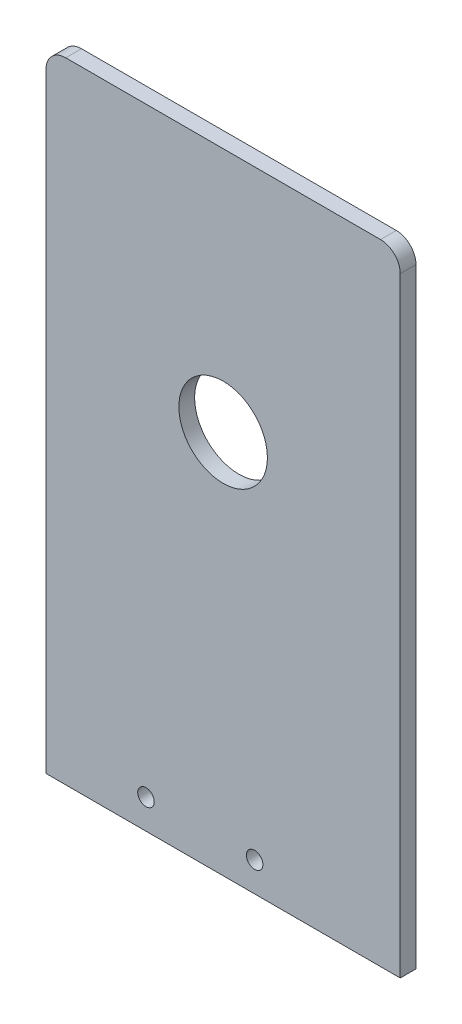
ISO-10303-21;
HEADER;
FILE_DESCRIPTION(('STEP AP214'),'2;1');
FILE_NAME('part.step','',(''),(''),'','','');
FILE_SCHEMA(('AUTOMOTIVE_DESIGN { 1 0 10303 214 1 1 1 1 }'));
ENDSEC;
DATA;
#1=APPLICATION_CONTEXT('core data for automotive mechanical design processes');
#2=APPLICATION_PROTOCOL_DEFINITION('international standard','automotive_design',2000,#1);
#3=PRODUCT_CONTEXT('',#1,'mechanical');
#4=PRODUCT('Part','Part','',(#3));
#5=PRODUCT_RELATED_PRODUCT_CATEGORY('part','',(#4));
#6=PRODUCT_DEFINITION_FORMATION('','',#4);
#7=PRODUCT_DEFINITION_CONTEXT('part definition',#1,'design');
#8=PRODUCT_DEFINITION('design','',#6,#7);
#9=PRODUCT_DEFINITION_SHAPE('','',#8);
#10=(LENGTH_UNIT() NAMED_UNIT(*) SI_UNIT(.MILLI.,.METRE.));
#11=(NAMED_UNIT(*) PLANE_ANGLE_UNIT() SI_UNIT($,.RADIAN.));
#12=(NAMED_UNIT(*) SI_UNIT($,.STERADIAN.) SOLID_ANGLE_UNIT());
#13=UNCERTAINTY_MEASURE_WITH_UNIT(LENGTH_MEASURE(1.E-05),#10,'distance_accuracy_value','');
#14=(GEOMETRIC_REPRESENTATION_CONTEXT(3) GLOBAL_UNCERTAINTY_ASSIGNED_CONTEXT((#13)) GLOBAL_UNIT_ASSIGNED_CONTEXT((#10,
#11,#12)) REPRESENTATION_CONTEXT('',''));
#15=CARTESIAN_POINT('',(0.,0.,0.));
#16=DIRECTION('',(0.,0.,1.));
#17=DIRECTION('',(1.,0.,0.));
#18=AXIS2_PLACEMENT_3D('',#15,#16,#17);
#19=CARTESIAN_POINT('',(57.15,-101.6,5.08));
#20=DIRECTION('',(-1.,0.,0.));
#21=DIRECTION('',(0.,0.,1.));
#22=AXIS2_PLACEMENT_3D('',#19,#20,#21);
#23=PLANE('',#22);
#24=DIRECTION('',(0.,1.,0.));
#25=VECTOR('',#24,1.);
#26=CARTESIAN_POINT('',(57.15,-101.6,0.));
#27=LINE('',#26,#25);
#28=CARTESIAN_POINT('',(57.15,-101.6,0.));
#29=VERTEX_POINT('',#28);
#30=CARTESIAN_POINT('',(57.15,95.25,0.));
#31=VERTEX_POINT('',#30);
#32=EDGE_CURVE('E116',#29,#31,#27,.T.);
#33=ORIENTED_EDGE('',*,*,#32,.T.);
#34=DIRECTION('',(0.,0.,-1.));
#35=VECTOR('',#34,1.);
#36=CARTESIAN_POINT('',(57.15,95.25,5.08));
#37=LINE('',#36,#35);
#38=CARTESIAN_POINT('',(57.15,95.25,5.08));
#39=VERTEX_POINT('',#38);
#40=EDGE_CURVE('E11',#31,#39,#37,.F.);
#41=ORIENTED_EDGE('',*,*,#40,.T.);
#42=DIRECTION('',(0.,1.,0.));
#43=VECTOR('',#42,1.);
#44=CARTESIAN_POINT('',(57.15,-101.6,5.08));
#45=LINE('',#44,#43);
#46=CARTESIAN_POINT('',(57.15,-101.6,5.08));
#47=VERTEX_POINT('',#46);
#48=EDGE_CURVE('E123',#47,#39,#45,.T.);
#49=ORIENTED_EDGE('',*,*,#48,.F.);
#50=DIRECTION('',(0.,0.,-1.));
#51=VECTOR('',#50,1.);
#52=CARTESIAN_POINT('',(57.15,-101.6,5.08));
#53=LINE('',#52,#51);
#54=EDGE_CURVE('E108',#47,#29,#53,.T.);
#55=ORIENTED_EDGE('',*,*,#54,.T.);
#56=EDGE_LOOP('',(#33,#41,#49,#55));
#57=FACE_BOUND('',#56,.T.);
#58=ADVANCED_FACE('F34',(#57),#23,.F.);
#59=CARTESIAN_POINT('',(-57.15,101.6,5.08));
#60=DIRECTION('',(0.,-1.,0.));
#61=DIRECTION('',(0.,0.,-1.));
#62=AXIS2_PLACEMENT_3D('',#59,#60,#61);
#63=PLANE('',#62);
#64=DIRECTION('',(-1.,0.,0.));
#65=VECTOR('',#64,1.);
#66=CARTESIAN_POINT('',(-57.15,101.6,0.));
#67=LINE('',#66,#65);
#68=CARTESIAN_POINT('',(50.8,101.6,0.));
#69=VERTEX_POINT('',#68);
#70=CARTESIAN_POINT('',(-50.8,101.6,0.));
#71=VERTEX_POINT('',#70);
#72=EDGE_CURVE('E118',#69,#71,#67,.T.);
#73=ORIENTED_EDGE('',*,*,#72,.T.);
#74=DIRECTION('',(0.,0.,-1.));
#75=VECTOR('',#74,1.);
#76=CARTESIAN_POINT('',(-50.8,101.6,5.08));
#77=LINE('',#76,#75);
#78=CARTESIAN_POINT('',(-50.8,101.6,5.08));
#79=VERTEX_POINT('',#78);
#80=EDGE_CURVE('E55',#71,#79,#77,.F.);
#81=ORIENTED_EDGE('',*,*,#80,.T.);
#82=DIRECTION('',(-1.,0.,0.));
#83=VECTOR('',#82,1.);
#84=CARTESIAN_POINT('',(-57.15,101.6,5.08));
#85=LINE('',#84,#83);
#86=CARTESIAN_POINT('',(50.8,101.6,5.08));
#87=VERTEX_POINT('',#86);
#88=EDGE_CURVE('E98',#87,#79,#85,.T.);
#89=ORIENTED_EDGE('',*,*,#88,.F.);
#90=DIRECTION('',(0.,0.,-1.));
#91=VECTOR('',#90,1.);
#92=CARTESIAN_POINT('',(50.8,101.6,5.08));
#93=LINE('',#92,#91);
#94=EDGE_CURVE('E130',#87,#69,#93,.T.);
#95=ORIENTED_EDGE('',*,*,#94,.T.);
#96=EDGE_LOOP('',(#73,#81,#89,#95));
#97=FACE_BOUND('',#96,.T.);
#98=ADVANCED_FACE('F138',(#97),#63,.F.);
#99=CARTESIAN_POINT('',(-57.15,-101.6,5.08));
#100=DIRECTION('',(1.,0.,0.));
#101=DIRECTION('',(0.,0.,-1.));
#102=AXIS2_PLACEMENT_3D('',#99,#100,#101);
#103=PLANE('',#102);
#104=DIRECTION('',(0.,-1.,0.));
#105=VECTOR('',#104,1.);
#106=CARTESIAN_POINT('',(-57.15,-101.6,5.08));
#107=LINE('',#106,#105);
#108=CARTESIAN_POINT('',(-57.15,95.25,5.08));
#109=VERTEX_POINT('',#108);
#110=CARTESIAN_POINT('',(-57.15,-101.6,5.08));
#111=VERTEX_POINT('',#110);
#112=EDGE_CURVE('E88',#109,#111,#107,.T.);
#113=ORIENTED_EDGE('',*,*,#112,.F.);
#114=DIRECTION('',(0.,0.,-1.));
#115=VECTOR('',#114,1.);
#116=CARTESIAN_POINT('',(-57.15,95.25,5.08));
#117=LINE('',#116,#115);
#118=CARTESIAN_POINT('',(-57.15,95.25,0.));
#119=VERTEX_POINT('',#118);
#120=EDGE_CURVE('E107',#109,#119,#117,.T.);
#121=ORIENTED_EDGE('',*,*,#120,.T.);
#122=DIRECTION('',(0.,-1.,0.));
#123=VECTOR('',#122,1.);
#124=CARTESIAN_POINT('',(-57.15,-101.6,0.));
#125=LINE('',#124,#123);
#126=CARTESIAN_POINT('',(-57.15,-101.6,0.));
#127=VERTEX_POINT('',#126);
#128=EDGE_CURVE('E104',#119,#127,#125,.T.);
#129=ORIENTED_EDGE('',*,*,#128,.T.);
#130=DIRECTION('',(0.,0.,-1.));
#131=VECTOR('',#130,1.);
#132=CARTESIAN_POINT('',(-57.15,-101.6,5.08));
#133=LINE('',#132,#131);
#134=EDGE_CURVE('E101',#111,#127,#133,.T.);
#135=ORIENTED_EDGE('',*,*,#134,.F.);
#136=EDGE_LOOP('',(#113,#121,#129,#135));
#137=FACE_BOUND('',#136,.T.);
#138=ADVANCED_FACE('F102',(#137),#103,.F.);
#139=CARTESIAN_POINT('',(-57.15,-101.6,5.08));
#140=DIRECTION('',(0.,1.,0.));
#141=DIRECTION('',(0.,0.,1.));
#142=AXIS2_PLACEMENT_3D('',#139,#140,#141);
#143=PLANE('',#142);
#144=DIRECTION('',(1.,0.,0.));
#145=VECTOR('',#144,1.);
#146=CARTESIAN_POINT('',(-57.15,-101.6,0.));
#147=LINE('',#146,#145);
#148=EDGE_CURVE('E122',#127,#29,#147,.T.);
#149=ORIENTED_EDGE('',*,*,#148,.T.);
#150=ORIENTED_EDGE('',*,*,#54,.F.);
#151=DIRECTION('',(1.,0.,0.));
#152=VECTOR('',#151,1.);
#153=CARTESIAN_POINT('',(-57.15,-101.6,5.08));
#154=LINE('',#153,#152);
#155=EDGE_CURVE('E92',#111,#47,#154,.T.);
#156=ORIENTED_EDGE('',*,*,#155,.F.);
#157=ORIENTED_EDGE('',*,*,#134,.T.);
#158=EDGE_LOOP('',(#149,#150,#156,#157));
#159=FACE_BOUND('',#158,.T.);
#160=ADVANCED_FACE('F110',(#159),#143,.F.);
#161=CARTESIAN_POINT('',(0.,0.,5.08));
#162=DIRECTION('',(0.,0.,-1.));
#163=DIRECTION('',(-1.,0.,0.));
#164=AXIS2_PLACEMENT_3D('',#161,#162,#163);
#165=PLANE('',#164);
#166=CARTESIAN_POINT('',(-24.892,-92.0750000000002,5.08));
#167=DIRECTION('',(0.,0.,1.));
#168=DIRECTION('',(1.,0.,0.));
#169=AXIS2_PLACEMENT_3D('',#166,#167,#168);
#170=CIRCLE('',#169,2.66699999999999);
#171=CARTESIAN_POINT('',(-22.225,-92.0750000000002,5.08));
#172=VERTEX_POINT('',#171);
#173=EDGE_CURVE('E154',#172,#172,#170,.T.);
#174=ORIENTED_EDGE('',*,*,#173,.F.);
#175=EDGE_LOOP('',(#174));
#176=FACE_BOUND('',#175,.T.);
#177=CARTESIAN_POINT('',(10.16,-92.075,5.08));
#178=DIRECTION('',(0.,0.,1.));
#179=DIRECTION('',(1.,0.,0.));
#180=AXIS2_PLACEMENT_3D('',#177,#178,#179);
#181=CIRCLE('',#180,2.66699999999999);
#182=CARTESIAN_POINT('',(12.827,-92.075,5.08));
#183=VERTEX_POINT('',#182);
#184=EDGE_CURVE('E155',#183,#183,#181,.T.);
#185=ORIENTED_EDGE('',*,*,#184,.F.);
#186=EDGE_LOOP('',(#185));
#187=FACE_BOUND('',#186,.T.);
#188=CARTESIAN_POINT('',(0.,22.352,5.08));
#189=DIRECTION('',(0.,0.,1.));
#190=DIRECTION('',(1.,0.,0.));
#191=AXIS2_PLACEMENT_3D('',#188,#189,#190);
#192=CIRCLE('',#191,14.2875);
#193=CARTESIAN_POINT('',(14.2875,22.352,5.08));
#194=VERTEX_POINT('',#193);
#195=EDGE_CURVE('E147',#194,#194,#192,.T.);
#196=ORIENTED_EDGE('',*,*,#195,.F.);
#197=EDGE_LOOP('',(#196));
#198=FACE_BOUND('',#197,.T.);
#199=ORIENTED_EDGE('',*,*,#88,.T.);
#200=CARTESIAN_POINT('',(-50.8,95.25,5.08));
#201=DIRECTION('',(0.,0.,-1.));
#202=DIRECTION('',(-1.,0.,0.));
#203=AXIS2_PLACEMENT_3D('',#200,#201,#202);
#204=CIRCLE('',#203,6.35);
#205=EDGE_CURVE('E42',#79,#109,#204,.F.);
#206=ORIENTED_EDGE('',*,*,#205,.T.);
#207=ORIENTED_EDGE('',*,*,#112,.T.);
#208=ORIENTED_EDGE('',*,*,#155,.T.);
#209=ORIENTED_EDGE('',*,*,#48,.T.);
#210=CARTESIAN_POINT('',(50.8,95.25,5.08));
#211=DIRECTION('',(0.,0.,-1.));
#212=DIRECTION('',(-1.,0.,0.));
#213=AXIS2_PLACEMENT_3D('',#210,#211,#212);
#214=CIRCLE('',#213,6.35);
#215=EDGE_CURVE('E134',#39,#87,#214,.F.);
#216=ORIENTED_EDGE('',*,*,#215,.T.);
#217=EDGE_LOOP('',(#199,#206,#207,#208,#209,#216));
#218=FACE_BOUND('',#217,.T.);
#219=ADVANCED_FACE('F90',(#176,#187,#198,#218),#165,.F.);
#220=CARTESIAN_POINT('',(0.,0.,0.));
#221=DIRECTION('',(0.,0.,-1.));
#222=DIRECTION('',(-1.,0.,0.));
#223=AXIS2_PLACEMENT_3D('',#220,#221,#222);
#224=PLANE('',#223);
#225=CARTESIAN_POINT('',(-24.892,-92.0750000000002,0.));
#226=DIRECTION('',(0.,0.,-1.));
#227=DIRECTION('',(-1.,0.,0.));
#228=AXIS2_PLACEMENT_3D('',#225,#226,#227);
#229=CIRCLE('',#228,2.66699999999999);
#230=CARTESIAN_POINT('',(-27.559,-92.0750000000002,0.));
#231=VERTEX_POINT('',#230);
#232=EDGE_CURVE('E150',#231,#231,#229,.F.);
#233=ORIENTED_EDGE('',*,*,#232,.T.);
#234=EDGE_LOOP('',(#233));
#235=FACE_BOUND('',#234,.T.);
#236=CARTESIAN_POINT('',(10.16,-92.075,0.));
#237=DIRECTION('',(0.,0.,-1.));
#238=DIRECTION('',(-1.,0.,0.));
#239=AXIS2_PLACEMENT_3D('',#236,#237,#238);
#240=CIRCLE('',#239,2.66699999999999);
#241=CARTESIAN_POINT('',(7.49300000000001,-92.075,0.));
#242=VERTEX_POINT('',#241);
#243=EDGE_CURVE('E151',#242,#242,#240,.F.);
#244=ORIENTED_EDGE('',*,*,#243,.T.);
#245=EDGE_LOOP('',(#244));
#246=FACE_BOUND('',#245,.T.);
#247=CARTESIAN_POINT('',(0.,22.352,0.));
#248=DIRECTION('',(0.,0.,-1.));
#249=DIRECTION('',(-1.,0.,0.));
#250=AXIS2_PLACEMENT_3D('',#247,#248,#249);
#251=CIRCLE('',#250,14.2875);
#252=CARTESIAN_POINT('',(-14.2875,22.352,0.));
#253=VERTEX_POINT('',#252);
#254=EDGE_CURVE('E119',#253,#253,#251,.F.);
#255=ORIENTED_EDGE('',*,*,#254,.T.);
#256=EDGE_LOOP('',(#255));
#257=FACE_BOUND('',#256,.T.);
#258=ORIENTED_EDGE('',*,*,#128,.F.);
#259=CARTESIAN_POINT('',(-50.8,95.25,0.));
#260=DIRECTION('',(0.,0.,-1.));
#261=DIRECTION('',(-1.,0.,0.));
#262=AXIS2_PLACEMENT_3D('',#259,#260,#261);
#263=CIRCLE('',#262,6.35);
#264=EDGE_CURVE('E128',#119,#71,#263,.T.);
#265=ORIENTED_EDGE('',*,*,#264,.T.);
#266=ORIENTED_EDGE('',*,*,#72,.F.);
#267=CARTESIAN_POINT('',(50.8,95.25,0.));
#268=DIRECTION('',(0.,0.,-1.));
#269=DIRECTION('',(-1.,0.,0.));
#270=AXIS2_PLACEMENT_3D('',#267,#268,#269);
#271=CIRCLE('',#270,6.35);
#272=EDGE_CURVE('E126',#69,#31,#271,.T.);
#273=ORIENTED_EDGE('',*,*,#272,.T.);
#274=ORIENTED_EDGE('',*,*,#32,.F.);
#275=ORIENTED_EDGE('',*,*,#148,.F.);
#276=EDGE_LOOP('',(#258,#265,#266,#273,#274,#275));
#277=FACE_BOUND('',#276,.T.);
#278=ADVANCED_FACE('F142',(#235,#246,#257,#277),#224,.T.);
#279=CARTESIAN_POINT('',(-50.8,95.25,5.08));
#280=DIRECTION('',(0.,0.,-1.));
#281=DIRECTION('',(-1.,0.,0.));
#282=AXIS2_PLACEMENT_3D('',#279,#280,#281);
#283=CYLINDRICAL_SURFACE('',#282,6.35);
#284=ORIENTED_EDGE('',*,*,#205,.F.);
#285=ORIENTED_EDGE('',*,*,#80,.F.);
#286=ORIENTED_EDGE('',*,*,#264,.F.);
#287=ORIENTED_EDGE('',*,*,#120,.F.);
#288=EDGE_LOOP('',(#284,#285,#286,#287));
#289=FACE_BOUND('',#288,.T.);
#290=ADVANCED_FACE('F181',(#289),#283,.T.);
#291=CARTESIAN_POINT('',(50.8,95.25,5.08));
#292=DIRECTION('',(0.,0.,-1.));
#293=DIRECTION('',(-1.,0.,0.));
#294=AXIS2_PLACEMENT_3D('',#291,#292,#293);
#295=CYLINDRICAL_SURFACE('',#294,6.35);
#296=ORIENTED_EDGE('',*,*,#215,.F.);
#297=ORIENTED_EDGE('',*,*,#40,.F.);
#298=ORIENTED_EDGE('',*,*,#272,.F.);
#299=ORIENTED_EDGE('',*,*,#94,.F.);
#300=EDGE_LOOP('',(#296,#297,#298,#299));
#301=FACE_BOUND('',#300,.T.);
#302=ADVANCED_FACE('F36',(#301),#295,.T.);
#303=CARTESIAN_POINT('',(0.,22.352,-40.4111525448112));
#304=DIRECTION('',(0.,0.,1.));
#305=DIRECTION('',(1.,0.,0.));
#306=AXIS2_PLACEMENT_3D('',#303,#304,#305);
#307=CYLINDRICAL_SURFACE('',#306,14.2875);
#308=ORIENTED_EDGE('',*,*,#195,.T.);
#309=EDGE_LOOP('',(#308));
#310=FACE_BOUND('',#309,.T.);
#311=ORIENTED_EDGE('',*,*,#254,.F.);
#312=EDGE_LOOP('',(#311));
#313=FACE_BOUND('',#312,.T.);
#314=ADVANCED_FACE('F173',(#310,#313),#307,.F.);
#315=CARTESIAN_POINT('',(10.16,-92.075,-7.54341514169807));
#316=DIRECTION('',(0.,0.,1.));
#317=DIRECTION('',(1.,0.,0.));
#318=AXIS2_PLACEMENT_3D('',#315,#316,#317);
#319=CYLINDRICAL_SURFACE('',#318,2.66699999999999);
#320=ORIENTED_EDGE('',*,*,#184,.T.);
#321=EDGE_LOOP('',(#320));
#322=FACE_BOUND('',#321,.T.);
#323=ORIENTED_EDGE('',*,*,#243,.F.);
#324=EDGE_LOOP('',(#323));
#325=FACE_BOUND('',#324,.T.);
#326=ADVANCED_FACE('F176',(#322,#325),#319,.F.);
#327=CARTESIAN_POINT('',(-24.892,-92.0750000000002,-7.54341514169807));
#328=DIRECTION('',(0.,0.,1.));
#329=DIRECTION('',(1.,0.,0.));
#330=AXIS2_PLACEMENT_3D('',#327,#328,#329);
#331=CYLINDRICAL_SURFACE('',#330,2.66699999999999);
#332=ORIENTED_EDGE('',*,*,#173,.T.);
#333=EDGE_LOOP('',(#332));
#334=FACE_BOUND('',#333,.T.);
#335=ORIENTED_EDGE('',*,*,#232,.F.);
#336=EDGE_LOOP('',(#335));
#337=FACE_BOUND('',#336,.T.);
#338=ADVANCED_FACE('F163',(#334,#337),#331,.F.);
#339=CLOSED_SHELL('',(#58,#98,#138,#160,#219,#278,#290,#302,#314,#326,#338));
#340=MANIFOLD_SOLID_BREP('B2',#339);
#341=ADVANCED_BREP_SHAPE_REPRESENTATION('',(#18,#340),#14);
#342=SHAPE_DEFINITION_REPRESENTATION(#9,#341);
ENDSEC;
END-ISO-10303-21;
